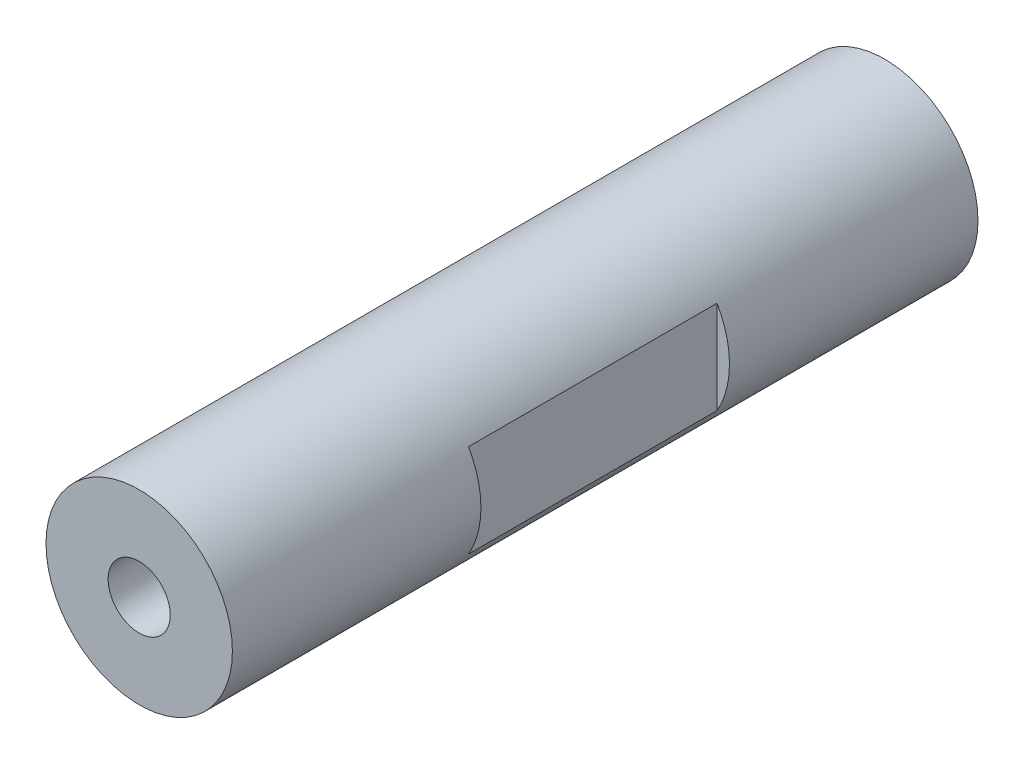
ISO-10303-21;
HEADER;
FILE_DESCRIPTION(('STEP AP214'),'2;1');
FILE_NAME('part.step','',(''),(''),'','','');
FILE_SCHEMA(('AUTOMOTIVE_DESIGN { 1 0 10303 214 1 1 1 1 }'));
ENDSEC;
DATA;
#1=APPLICATION_CONTEXT('core data for automotive mechanical design processes');
#2=APPLICATION_PROTOCOL_DEFINITION('international standard','automotive_design',2000,#1);
#3=PRODUCT_CONTEXT('',#1,'mechanical');
#4=PRODUCT('Part','Part','',(#3));
#5=PRODUCT_RELATED_PRODUCT_CATEGORY('part','',(#4));
#6=PRODUCT_DEFINITION_FORMATION('','',#4);
#7=PRODUCT_DEFINITION_CONTEXT('part definition',#1,'design');
#8=PRODUCT_DEFINITION('design','',#6,#7);
#9=PRODUCT_DEFINITION_SHAPE('','',#8);
#10=(LENGTH_UNIT() NAMED_UNIT(*) SI_UNIT(.MILLI.,.METRE.));
#11=(NAMED_UNIT(*) PLANE_ANGLE_UNIT() SI_UNIT($,.RADIAN.));
#12=(NAMED_UNIT(*) SI_UNIT($,.STERADIAN.) SOLID_ANGLE_UNIT());
#13=UNCERTAINTY_MEASURE_WITH_UNIT(LENGTH_MEASURE(1.E-05),#10,'distance_accuracy_value','');
#14=(GEOMETRIC_REPRESENTATION_CONTEXT(3) GLOBAL_UNCERTAINTY_ASSIGNED_CONTEXT((#13)) GLOBAL_UNIT_ASSIGNED_CONTEXT((#10,
#11,#12)) REPRESENTATION_CONTEXT('',''));
#15=CARTESIAN_POINT('',(0.,0.,0.));
#16=DIRECTION('',(0.,0.,1.));
#17=DIRECTION('',(1.,0.,0.));
#18=AXIS2_PLACEMENT_3D('',#15,#16,#17);
#19=CARTESIAN_POINT('',(0.,0.,30.));
#20=DIRECTION('',(0.,0.,-1.));
#21=DIRECTION('',(-1.,0.,0.));
#22=AXIS2_PLACEMENT_3D('',#19,#20,#21);
#23=CYLINDRICAL_SURFACE('',#22,7.5);
#24=DIRECTION('',(0.,0.,-1.));
#25=VECTOR('',#24,1.);
#26=CARTESIAN_POINT('',(6.5,3.74165738677394,30.));
#27=LINE('',#26,#25);
#28=CARTESIAN_POINT('',(6.5,3.74165738677394,10.));
#29=VERTEX_POINT('',#28);
#30=CARTESIAN_POINT('',(6.5,3.74165738677394,-9.99999999999999));
#31=VERTEX_POINT('',#30);
#32=EDGE_CURVE('E43',#29,#31,#27,.T.);
#33=ORIENTED_EDGE('',*,*,#32,.T.);
#34=CARTESIAN_POINT('',(0.,0.,-9.99999999999999));
#35=DIRECTION('',(0.,0.,-1.));
#36=DIRECTION('',(-1.,0.,0.));
#37=AXIS2_PLACEMENT_3D('',#34,#35,#36);
#38=CIRCLE('',#37,7.5);
#39=CARTESIAN_POINT('',(6.5,-3.74165738677394,-9.99999999999999));
#40=VERTEX_POINT('',#39);
#41=EDGE_CURVE('E11',#31,#40,#38,.T.);
#42=ORIENTED_EDGE('',*,*,#41,.T.);
#43=DIRECTION('',(0.,0.,-1.));
#44=VECTOR('',#43,1.);
#45=CARTESIAN_POINT('',(6.5,-3.74165738677394,30.));
#46=LINE('',#45,#44);
#47=CARTESIAN_POINT('',(6.5,-3.74165738677394,10.));
#48=VERTEX_POINT('',#47);
#49=EDGE_CURVE('E130',#40,#48,#46,.F.);
#50=ORIENTED_EDGE('',*,*,#49,.T.);
#51=CARTESIAN_POINT('',(0.,0.,10.));
#52=DIRECTION('',(0.,0.,1.));
#53=DIRECTION('',(1.,0.,0.));
#54=AXIS2_PLACEMENT_3D('',#51,#52,#53);
#55=CIRCLE('',#54,7.5);
#56=EDGE_CURVE('E127',#48,#29,#55,.T.);
#57=ORIENTED_EDGE('',*,*,#56,.T.);
#58=EDGE_LOOP('',(#33,#42,#50,#57));
#59=FACE_BOUND('',#58,.T.);
#60=DIRECTION('',(0.,0.,-1.));
#61=VECTOR('',#60,1.);
#62=CARTESIAN_POINT('',(-6.5,-3.74165738677394,30.));
#63=LINE('',#62,#61);
#64=CARTESIAN_POINT('',(-6.5,-3.74165738677394,10.));
#65=VERTEX_POINT('',#64);
#66=CARTESIAN_POINT('',(-6.5,-3.74165738677394,-10.));
#67=VERTEX_POINT('',#66);
#68=EDGE_CURVE('E121',#65,#67,#63,.T.);
#69=ORIENTED_EDGE('',*,*,#68,.T.);
#70=CARTESIAN_POINT('',(0.,0.,-9.99999999999999));
#71=DIRECTION('',(0.,0.,-1.));
#72=DIRECTION('',(-1.,0.,0.));
#73=AXIS2_PLACEMENT_3D('',#70,#71,#72);
#74=CIRCLE('',#73,7.5);
#75=CARTESIAN_POINT('',(-6.5,3.74165738677394,-10.));
#76=VERTEX_POINT('',#75);
#77=EDGE_CURVE('E124',#67,#76,#74,.T.);
#78=ORIENTED_EDGE('',*,*,#77,.T.);
#79=DIRECTION('',(0.,0.,-1.));
#80=VECTOR('',#79,1.);
#81=CARTESIAN_POINT('',(-6.5,3.74165738677394,30.));
#82=LINE('',#81,#80);
#83=CARTESIAN_POINT('',(-6.5,3.74165738677394,10.));
#84=VERTEX_POINT('',#83);
#85=EDGE_CURVE('E118',#76,#84,#82,.F.);
#86=ORIENTED_EDGE('',*,*,#85,.T.);
#87=CARTESIAN_POINT('',(0.,0.,10.));
#88=DIRECTION('',(0.,0.,1.));
#89=DIRECTION('',(1.,0.,0.));
#90=AXIS2_PLACEMENT_3D('',#87,#88,#89);
#91=CIRCLE('',#90,7.5);
#92=EDGE_CURVE('E113',#84,#65,#91,.T.);
#93=ORIENTED_EDGE('',*,*,#92,.T.);
#94=EDGE_LOOP('',(#69,#78,#86,#93));
#95=FACE_BOUND('',#94,.T.);
#96=CARTESIAN_POINT('',(0.,0.,30.));
#97=DIRECTION('',(0.,0.,1.));
#98=DIRECTION('',(1.,0.,0.));
#99=AXIS2_PLACEMENT_3D('',#96,#97,#98);
#100=CIRCLE('',#99,7.5);
#101=CARTESIAN_POINT('',(7.5,0.,30.));
#102=VERTEX_POINT('',#101);
#103=EDGE_CURVE('E110',#102,#102,#100,.T.);
#104=ORIENTED_EDGE('',*,*,#103,.F.);
#105=EDGE_LOOP('',(#104));
#106=FACE_BOUND('',#105,.T.);
#107=CARTESIAN_POINT('',(0.,0.,-30.));
#108=DIRECTION('',(0.,0.,1.));
#109=DIRECTION('',(1.,0.,0.));
#110=AXIS2_PLACEMENT_3D('',#107,#108,#109);
#111=CIRCLE('',#110,7.5);
#112=CARTESIAN_POINT('',(7.5,0.,-30.));
#113=VERTEX_POINT('',#112);
#114=EDGE_CURVE('E108',#113,#113,#111,.T.);
#115=ORIENTED_EDGE('',*,*,#114,.T.);
#116=EDGE_LOOP('',(#115));
#117=FACE_BOUND('',#116,.T.);
#118=ADVANCED_FACE('F36',(#59,#95,#106,#117),#23,.T.);
#119=CARTESIAN_POINT('',(0.,0.,30.));
#120=DIRECTION('',(0.,0.,1.));
#121=DIRECTION('',(1.,0.,0.));
#122=AXIS2_PLACEMENT_3D('',#119,#120,#121);
#123=PLANE('',#122);
#124=CARTESIAN_POINT('',(0.,0.,30.));
#125=DIRECTION('',(0.,0.,1.));
#126=DIRECTION('',(1.,0.,0.));
#127=AXIS2_PLACEMENT_3D('',#124,#125,#126);
#128=CIRCLE('',#127,2.5);
#129=CARTESIAN_POINT('',(2.5,0.,30.));
#130=VERTEX_POINT('',#129);
#131=EDGE_CURVE('E91',#130,#130,#128,.T.);
#132=ORIENTED_EDGE('',*,*,#131,.F.);
#133=EDGE_LOOP('',(#132));
#134=FACE_BOUND('',#133,.T.);
#135=ORIENTED_EDGE('',*,*,#103,.T.);
#136=EDGE_LOOP('',(#135));
#137=FACE_BOUND('',#136,.T.);
#138=ADVANCED_FACE('F153',(#134,#137),#123,.T.);
#139=CARTESIAN_POINT('',(0.,0.,-30.));
#140=DIRECTION('',(0.,0.,1.));
#141=DIRECTION('',(1.,0.,0.));
#142=AXIS2_PLACEMENT_3D('',#139,#140,#141);
#143=PLANE('',#142);
#144=CARTESIAN_POINT('',(0.,0.,-30.));
#145=DIRECTION('',(0.,0.,-1.));
#146=DIRECTION('',(-1.,0.,0.));
#147=AXIS2_PLACEMENT_3D('',#144,#145,#146);
#148=CIRCLE('',#147,2.5);
#149=CARTESIAN_POINT('',(-2.5,0.,-30.));
#150=VERTEX_POINT('',#149);
#151=EDGE_CURVE('E90',#150,#150,#148,.T.);
#152=ORIENTED_EDGE('',*,*,#151,.F.);
#153=EDGE_LOOP('',(#152));
#154=FACE_BOUND('',#153,.T.);
#155=ORIENTED_EDGE('',*,*,#114,.F.);
#156=EDGE_LOOP('',(#155));
#157=FACE_BOUND('',#156,.T.);
#158=ADVANCED_FACE('F157',(#154,#157),#143,.F.);
#159=CARTESIAN_POINT('',(-6.5,-10.,-10.));
#160=DIRECTION('',(0.,0.,-1.));
#161=DIRECTION('',(-1.,0.,0.));
#162=AXIS2_PLACEMENT_3D('',#159,#160,#161);
#163=PLANE('',#162);
#164=DIRECTION('',(0.,1.,0.));
#165=VECTOR('',#164,1.);
#166=CARTESIAN_POINT('',(-6.5,-10.,-10.));
#167=LINE('',#166,#165);
#168=EDGE_CURVE('E105',#67,#76,#167,.T.);
#169=ORIENTED_EDGE('',*,*,#168,.T.);
#170=ORIENTED_EDGE('',*,*,#77,.F.);
#171=EDGE_LOOP('',(#169,#170));
#172=FACE_BOUND('',#171,.T.);
#173=ADVANCED_FACE('F163',(#172),#163,.F.);
#174=CARTESIAN_POINT('',(-6.5,-10.,10.));
#175=DIRECTION('',(1.,0.,0.));
#176=DIRECTION('',(0.,0.,-1.));
#177=AXIS2_PLACEMENT_3D('',#174,#175,#176);
#178=PLANE('',#177);
#179=DIRECTION('',(0.,1.,0.));
#180=VECTOR('',#179,1.);
#181=CARTESIAN_POINT('',(-6.5,-10.,10.));
#182=LINE('',#181,#180);
#183=EDGE_CURVE('E56',#65,#84,#182,.T.);
#184=ORIENTED_EDGE('',*,*,#183,.T.);
#185=ORIENTED_EDGE('',*,*,#85,.F.);
#186=ORIENTED_EDGE('',*,*,#168,.F.);
#187=ORIENTED_EDGE('',*,*,#68,.F.);
#188=EDGE_LOOP('',(#184,#185,#186,#187));
#189=FACE_BOUND('',#188,.T.);
#190=ADVANCED_FACE('F170',(#189),#178,.F.);
#191=CARTESIAN_POINT('',(-6.5,-10.,10.));
#192=DIRECTION('',(0.,0.,1.));
#193=DIRECTION('',(1.,0.,0.));
#194=AXIS2_PLACEMENT_3D('',#191,#192,#193);
#195=PLANE('',#194);
#196=ORIENTED_EDGE('',*,*,#183,.F.);
#197=ORIENTED_EDGE('',*,*,#92,.F.);
#198=EDGE_LOOP('',(#196,#197));
#199=FACE_BOUND('',#198,.T.);
#200=ADVANCED_FACE('F149',(#199),#195,.F.);
#201=CARTESIAN_POINT('',(6.5,-10.,10.));
#202=DIRECTION('',(-1.,0.,0.));
#203=DIRECTION('',(0.,0.,1.));
#204=AXIS2_PLACEMENT_3D('',#201,#202,#203);
#205=PLANE('',#204);
#206=DIRECTION('',(0.,1.,0.));
#207=VECTOR('',#206,1.);
#208=CARTESIAN_POINT('',(6.5,-10.,10.));
#209=LINE('',#208,#207);
#210=EDGE_CURVE('E49',#48,#29,#209,.T.);
#211=ORIENTED_EDGE('',*,*,#210,.F.);
#212=ORIENTED_EDGE('',*,*,#49,.F.);
#213=DIRECTION('',(0.,1.,0.));
#214=VECTOR('',#213,1.);
#215=CARTESIAN_POINT('',(6.5,-10.,-10.));
#216=LINE('',#215,#214);
#217=EDGE_CURVE('E101',#40,#31,#216,.T.);
#218=ORIENTED_EDGE('',*,*,#217,.T.);
#219=ORIENTED_EDGE('',*,*,#32,.F.);
#220=EDGE_LOOP('',(#211,#212,#218,#219));
#221=FACE_BOUND('',#220,.T.);
#222=ADVANCED_FACE('F136',(#221),#205,.F.);
#223=CARTESIAN_POINT('',(6.5,-10.,-10.));
#224=DIRECTION('',(0.,0.,-1.));
#225=DIRECTION('',(-1.,0.,0.));
#226=AXIS2_PLACEMENT_3D('',#223,#224,#225);
#227=PLANE('',#226);
#228=ORIENTED_EDGE('',*,*,#217,.F.);
#229=ORIENTED_EDGE('',*,*,#41,.F.);
#230=EDGE_LOOP('',(#228,#229));
#231=FACE_BOUND('',#230,.T.);
#232=ADVANCED_FACE('F139',(#231),#227,.F.);
#233=CARTESIAN_POINT('',(6.5,-10.,10.));
#234=DIRECTION('',(0.,0.,1.));
#235=DIRECTION('',(1.,0.,0.));
#236=AXIS2_PLACEMENT_3D('',#233,#234,#235);
#237=PLANE('',#236);
#238=ORIENTED_EDGE('',*,*,#210,.T.);
#239=ORIENTED_EDGE('',*,*,#56,.F.);
#240=EDGE_LOOP('',(#238,#239));
#241=FACE_BOUND('',#240,.T.);
#242=ADVANCED_FACE('F141',(#241),#237,.F.);
#243=CARTESIAN_POINT('',(0.,0.,-15.));
#244=DIRECTION('',(0.,0.,-1.));
#245=DIRECTION('',(-1.,0.,0.));
#246=AXIS2_PLACEMENT_3D('',#243,#244,#245);
#247=CONICAL_SURFACE('',#246,2.5,1.02974425867665);
#248=CARTESIAN_POINT('',(0.,0.,-13.4978484524311));
#249=VERTEX_POINT('',#248);
#250=VERTEX_LOOP('',#249);
#251=FACE_BOUND('',#250,.T.);
#252=CARTESIAN_POINT('',(0.,0.,-15.));
#253=DIRECTION('',(0.,0.,-1.));
#254=DIRECTION('',(-1.,0.,0.));
#255=AXIS2_PLACEMENT_3D('',#252,#253,#254);
#256=CIRCLE('',#255,2.5);
#257=CARTESIAN_POINT('',(-2.5,0.,-15.));
#258=VERTEX_POINT('',#257);
#259=EDGE_CURVE('E94',#258,#258,#256,.T.);
#260=ORIENTED_EDGE('',*,*,#259,.T.);
#261=EDGE_LOOP('',(#260));
#262=FACE_BOUND('',#261,.T.);
#263=ADVANCED_FACE('F147',(#251,#262),#247,.F.);
#264=CARTESIAN_POINT('',(0.,0.,-30.));
#265=DIRECTION('',(0.,0.,-1.));
#266=DIRECTION('',(-1.,0.,0.));
#267=AXIS2_PLACEMENT_3D('',#264,#265,#266);
#268=CYLINDRICAL_SURFACE('',#267,2.5);
#269=ORIENTED_EDGE('',*,*,#259,.F.);
#270=EDGE_LOOP('',(#269));
#271=FACE_BOUND('',#270,.T.);
#272=ORIENTED_EDGE('',*,*,#151,.T.);
#273=EDGE_LOOP('',(#272));
#274=FACE_BOUND('',#273,.T.);
#275=ADVANCED_FACE('F84',(#271,#274),#268,.F.);
#276=CARTESIAN_POINT('',(0.,0.,15.));
#277=DIRECTION('',(0.,0.,1.));
#278=DIRECTION('',(1.,0.,0.));
#279=AXIS2_PLACEMENT_3D('',#276,#277,#278);
#280=CONICAL_SURFACE('',#279,2.5,1.02974425867665);
#281=CARTESIAN_POINT('',(0.,0.,13.4978484524311));
#282=VERTEX_POINT('',#281);
#283=VERTEX_LOOP('',#282);
#284=FACE_BOUND('',#283,.T.);
#285=CARTESIAN_POINT('',(0.,0.,15.));
#286=DIRECTION('',(0.,0.,1.));
#287=DIRECTION('',(1.,0.,0.));
#288=AXIS2_PLACEMENT_3D('',#285,#286,#287);
#289=CIRCLE('',#288,2.5);
#290=CARTESIAN_POINT('',(2.5,0.,15.));
#291=VERTEX_POINT('',#290);
#292=EDGE_CURVE('E88',#291,#291,#289,.T.);
#293=ORIENTED_EDGE('',*,*,#292,.T.);
#294=EDGE_LOOP('',(#293));
#295=FACE_BOUND('',#294,.T.);
#296=ADVANCED_FACE('F80',(#284,#295),#280,.F.);
#297=CARTESIAN_POINT('',(0.,0.,30.));
#298=DIRECTION('',(0.,0.,1.));
#299=DIRECTION('',(1.,0.,0.));
#300=AXIS2_PLACEMENT_3D('',#297,#298,#299);
#301=CYLINDRICAL_SURFACE('',#300,2.5);
#302=ORIENTED_EDGE('',*,*,#292,.F.);
#303=EDGE_LOOP('',(#302));
#304=FACE_BOUND('',#303,.T.);
#305=ORIENTED_EDGE('',*,*,#131,.T.);
#306=EDGE_LOOP('',(#305));
#307=FACE_BOUND('',#306,.T.);
#308=ADVANCED_FACE('F83',(#304,#307),#301,.F.);
#309=CLOSED_SHELL('',(#118,#138,#158,#173,#190,#200,#222,#232,#242,#263,#275,#296,#308));
#310=MANIFOLD_SOLID_BREP('B2',#309);
#311=ADVANCED_BREP_SHAPE_REPRESENTATION('',(#18,#310),#14);
#312=SHAPE_DEFINITION_REPRESENTATION(#9,#311);
ENDSEC;
END-ISO-10303-21;
